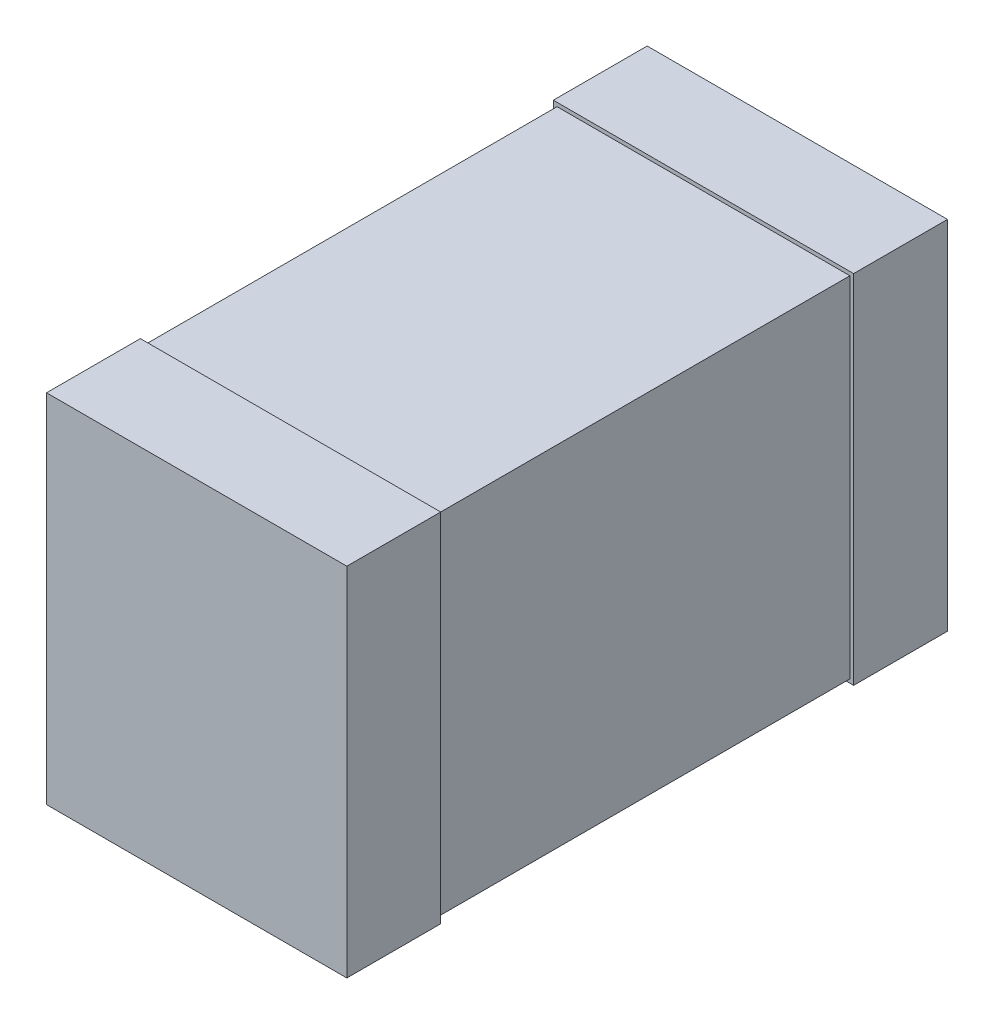
ISO-10303-21;
HEADER;
FILE_DESCRIPTION(('STEP AP214'),'2;1');
FILE_NAME('part.step','',(''),(''),'','','');
FILE_SCHEMA(('AUTOMOTIVE_DESIGN { 1 0 10303 214 1 1 1 1 }'));
ENDSEC;
DATA;
#1=APPLICATION_CONTEXT('core data for automotive mechanical design processes');
#2=APPLICATION_PROTOCOL_DEFINITION('international standard','automotive_design',2000,#1);
#3=PRODUCT_CONTEXT('',#1,'mechanical');
#4=PRODUCT('Part','Part','',(#3));
#5=PRODUCT_RELATED_PRODUCT_CATEGORY('part','',(#4));
#6=PRODUCT_DEFINITION_FORMATION('','',#4);
#7=PRODUCT_DEFINITION_CONTEXT('part definition',#1,'design');
#8=PRODUCT_DEFINITION('design','',#6,#7);
#9=PRODUCT_DEFINITION_SHAPE('','',#8);
#10=(LENGTH_UNIT() NAMED_UNIT(*) SI_UNIT(.MILLI.,.METRE.));
#11=(NAMED_UNIT(*) PLANE_ANGLE_UNIT() SI_UNIT($,.RADIAN.));
#12=(NAMED_UNIT(*) SI_UNIT($,.STERADIAN.) SOLID_ANGLE_UNIT());
#13=UNCERTAINTY_MEASURE_WITH_UNIT(LENGTH_MEASURE(1.E-05),#10,'distance_accuracy_value','');
#14=(GEOMETRIC_REPRESENTATION_CONTEXT(3) GLOBAL_UNCERTAINTY_ASSIGNED_CONTEXT((#13)) GLOBAL_UNIT_ASSIGNED_CONTEXT((#10,
#11,#12)) REPRESENTATION_CONTEXT('',''));
#15=CARTESIAN_POINT('',(0.,0.,0.));
#16=DIRECTION('',(0.,0.,1.));
#17=DIRECTION('',(1.,0.,0.));
#18=AXIS2_PLACEMENT_3D('',#15,#16,#17);
#19=CARTESIAN_POINT('',(0.8,-0.95,1.6));
#20=DIRECTION('',(0.,0.,-1.));
#21=DIRECTION('',(-1.,0.,0.));
#22=AXIS2_PLACEMENT_3D('',#19,#20,#21);
#23=PLANE('',#22);
#24=DIRECTION('',(-1.,0.,0.));
#25=VECTOR('',#24,1.);
#26=CARTESIAN_POINT('',(0.,0.95,1.6));
#27=LINE('',#26,#25);
#28=CARTESIAN_POINT('',(0.8,0.95,1.6));
#29=VERTEX_POINT('',#28);
#30=CARTESIAN_POINT('',(-0.8,0.95,1.6));
#31=VERTEX_POINT('',#30);
#32=EDGE_CURVE('E108',#29,#31,#27,.T.);
#33=ORIENTED_EDGE('',*,*,#32,.T.);
#34=DIRECTION('',(0.,-1.,0.));
#35=VECTOR('',#34,1.);
#36=CARTESIAN_POINT('',(-0.8,0.,1.6));
#37=LINE('',#36,#35);
#38=CARTESIAN_POINT('',(-0.8,-0.95,1.6));
#39=VERTEX_POINT('',#38);
#40=EDGE_CURVE('E103',#31,#39,#37,.T.);
#41=ORIENTED_EDGE('',*,*,#40,.T.);
#42=DIRECTION('',(-1.,0.,0.));
#43=VECTOR('',#42,1.);
#44=CARTESIAN_POINT('',(0.,-0.95,1.6));
#45=LINE('',#44,#43);
#46=CARTESIAN_POINT('',(0.8,-0.95,1.6));
#47=VERTEX_POINT('',#46);
#48=EDGE_CURVE('E20',#47,#39,#45,.T.);
#49=ORIENTED_EDGE('',*,*,#48,.F.);
#50=DIRECTION('',(0.,1.,0.));
#51=VECTOR('',#50,1.);
#52=CARTESIAN_POINT('',(0.8,0.,1.6));
#53=LINE('',#52,#51);
#54=EDGE_CURVE('E117',#47,#29,#53,.T.);
#55=ORIENTED_EDGE('',*,*,#54,.T.);
#56=EDGE_LOOP('',(#33,#41,#49,#55));
#57=FACE_BOUND('',#56,.T.);
#58=ADVANCED_FACE('F16',(#57),#23,.F.);
#59=CARTESIAN_POINT('',(0.8,-0.95,1.1));
#60=DIRECTION('',(-1.,0.,0.));
#61=DIRECTION('',(0.,0.,1.));
#62=AXIS2_PLACEMENT_3D('',#59,#60,#61);
#63=PLANE('',#62);
#64=DIRECTION('',(0.,1.,0.));
#65=VECTOR('',#64,1.);
#66=CARTESIAN_POINT('',(0.8,0.,1.1));
#67=LINE('',#66,#65);
#68=CARTESIAN_POINT('',(0.8,-0.95,1.1));
#69=VERTEX_POINT('',#68);
#70=CARTESIAN_POINT('',(0.8,0.95,1.1));
#71=VERTEX_POINT('',#70);
#72=EDGE_CURVE('E125',#69,#71,#67,.T.);
#73=ORIENTED_EDGE('',*,*,#72,.T.);
#74=DIRECTION('',(0.,0.,1.));
#75=VECTOR('',#74,1.);
#76=CARTESIAN_POINT('',(0.8,0.95,1.35));
#77=LINE('',#76,#75);
#78=EDGE_CURVE('E113',#71,#29,#77,.T.);
#79=ORIENTED_EDGE('',*,*,#78,.T.);
#80=ORIENTED_EDGE('',*,*,#54,.F.);
#81=DIRECTION('',(0.,0.,-1.));
#82=VECTOR('',#81,1.);
#83=CARTESIAN_POINT('',(0.8,-0.95,1.35));
#84=LINE('',#83,#82);
#85=EDGE_CURVE('E130',#47,#69,#84,.T.);
#86=ORIENTED_EDGE('',*,*,#85,.T.);
#87=EDGE_LOOP('',(#73,#79,#80,#86));
#88=FACE_BOUND('',#87,.T.);
#89=ADVANCED_FACE('F124',(#88),#63,.F.);
#90=CARTESIAN_POINT('',(-0.8,0.95,1.6));
#91=DIRECTION('',(0.,-1.,0.));
#92=DIRECTION('',(0.,0.,-1.));
#93=AXIS2_PLACEMENT_3D('',#90,#91,#92);
#94=PLANE('',#93);
#95=DIRECTION('',(-1.,0.,0.));
#96=VECTOR('',#95,1.);
#97=CARTESIAN_POINT('',(0.,0.95,1.1));
#98=LINE('',#97,#96);
#99=CARTESIAN_POINT('',(-0.8,0.95,1.1));
#100=VERTEX_POINT('',#99);
#101=EDGE_CURVE('E135',#71,#100,#98,.T.);
#102=ORIENTED_EDGE('',*,*,#101,.T.);
#103=DIRECTION('',(0.,0.,1.));
#104=VECTOR('',#103,1.);
#105=CARTESIAN_POINT('',(-0.8,0.95,1.35));
#106=LINE('',#105,#104);
#107=EDGE_CURVE('E115',#100,#31,#106,.T.);
#108=ORIENTED_EDGE('',*,*,#107,.T.);
#109=ORIENTED_EDGE('',*,*,#32,.F.);
#110=ORIENTED_EDGE('',*,*,#78,.F.);
#111=EDGE_LOOP('',(#102,#108,#109,#110));
#112=FACE_BOUND('',#111,.T.);
#113=ADVANCED_FACE('F111',(#112),#94,.F.);
#114=CARTESIAN_POINT('',(-0.8,-0.95,1.6));
#115=DIRECTION('',(1.,0.,0.));
#116=DIRECTION('',(0.,0.,-1.));
#117=AXIS2_PLACEMENT_3D('',#114,#115,#116);
#118=PLANE('',#117);
#119=DIRECTION('',(0.,-1.,0.));
#120=VECTOR('',#119,1.);
#121=CARTESIAN_POINT('',(-0.8,0.,1.1));
#122=LINE('',#121,#120);
#123=CARTESIAN_POINT('',(-0.8,-0.95,1.1));
#124=VERTEX_POINT('',#123);
#125=EDGE_CURVE('E137',#100,#124,#122,.T.);
#126=ORIENTED_EDGE('',*,*,#125,.T.);
#127=DIRECTION('',(0.,0.,1.));
#128=VECTOR('',#127,1.);
#129=CARTESIAN_POINT('',(-0.8,-0.95,1.35));
#130=LINE('',#129,#128);
#131=EDGE_CURVE('E132',#124,#39,#130,.T.);
#132=ORIENTED_EDGE('',*,*,#131,.T.);
#133=ORIENTED_EDGE('',*,*,#40,.F.);
#134=ORIENTED_EDGE('',*,*,#107,.F.);
#135=EDGE_LOOP('',(#126,#132,#133,#134));
#136=FACE_BOUND('',#135,.T.);
#137=ADVANCED_FACE('F252',(#136),#118,.F.);
#138=CARTESIAN_POINT('',(-0.8,-0.95,1.1));
#139=DIRECTION('',(0.,1.,0.));
#140=DIRECTION('',(0.,0.,1.));
#141=AXIS2_PLACEMENT_3D('',#138,#139,#140);
#142=PLANE('',#141);
#143=DIRECTION('',(1.,0.,0.));
#144=VECTOR('',#143,1.);
#145=CARTESIAN_POINT('',(0.,-0.95,1.1));
#146=LINE('',#145,#144);
#147=EDGE_CURVE('E140',#124,#69,#146,.T.);
#148=ORIENTED_EDGE('',*,*,#147,.T.);
#149=ORIENTED_EDGE('',*,*,#85,.F.);
#150=ORIENTED_EDGE('',*,*,#48,.T.);
#151=ORIENTED_EDGE('',*,*,#131,.F.);
#152=EDGE_LOOP('',(#148,#149,#150,#151));
#153=FACE_BOUND('',#152,.T.);
#154=ADVANCED_FACE('F248',(#153),#142,.F.);
#155=CARTESIAN_POINT('',(-0.8,-0.95,1.1));
#156=DIRECTION('',(0.,0.,1.));
#157=DIRECTION('',(1.,0.,0.));
#158=AXIS2_PLACEMENT_3D('',#155,#156,#157);
#159=PLANE('',#158);
#160=DIRECTION('',(1.,0.,0.));
#161=VECTOR('',#160,1.);
#162=CARTESIAN_POINT('',(0.,0.93,1.1));
#163=LINE('',#162,#161);
#164=CARTESIAN_POINT('',(-0.78,0.9299999998,1.1));
#165=VERTEX_POINT('',#164);
#166=CARTESIAN_POINT('',(0.78,0.9299999998,1.1));
#167=VERTEX_POINT('',#166);
#168=EDGE_CURVE('E147',#165,#167,#163,.T.);
#169=ORIENTED_EDGE('',*,*,#168,.F.);
#170=DIRECTION('',(0.,1.,0.));
#171=VECTOR('',#170,1.);
#172=CARTESIAN_POINT('',(-0.78,0.,1.1));
#173=LINE('',#172,#171);
#174=CARTESIAN_POINT('',(-0.78,-0.9299999998,1.1));
#175=VERTEX_POINT('',#174);
#176=EDGE_CURVE('E160',#175,#165,#173,.T.);
#177=ORIENTED_EDGE('',*,*,#176,.F.);
#178=DIRECTION('',(-1.,0.,0.));
#179=VECTOR('',#178,1.);
#180=CARTESIAN_POINT('',(0.,-0.93,1.1));
#181=LINE('',#180,#179);
#182=CARTESIAN_POINT('',(0.78,-0.9299999998,1.1));
#183=VERTEX_POINT('',#182);
#184=EDGE_CURVE('E143',#183,#175,#181,.T.);
#185=ORIENTED_EDGE('',*,*,#184,.F.);
#186=DIRECTION('',(0.,-1.,0.));
#187=VECTOR('',#186,1.);
#188=CARTESIAN_POINT('',(0.78,0.,1.1));
#189=LINE('',#188,#187);
#190=EDGE_CURVE('E168',#167,#183,#189,.T.);
#191=ORIENTED_EDGE('',*,*,#190,.F.);
#192=EDGE_LOOP('',(#169,#177,#185,#191));
#193=FACE_BOUND('',#192,.T.);
#194=ORIENTED_EDGE('',*,*,#125,.F.);
#195=ORIENTED_EDGE('',*,*,#101,.F.);
#196=ORIENTED_EDGE('',*,*,#72,.F.);
#197=ORIENTED_EDGE('',*,*,#147,.F.);
#198=EDGE_LOOP('',(#194,#195,#196,#197));
#199=FACE_BOUND('',#198,.T.);
#200=ADVANCED_FACE('F244',(#193,#199),#159,.F.);
#201=CARTESIAN_POINT('',(-0.78,-0.93,1.1));
#202=DIRECTION('',(0.,-1.,0.));
#203=DIRECTION('',(0.,0.,-1.));
#204=AXIS2_PLACEMENT_3D('',#201,#202,#203);
#205=PLANE('',#204);
#206=DIRECTION('',(1.,0.,0.));
#207=VECTOR('',#206,1.);
#208=CARTESIAN_POINT('',(0.,-0.93,-1.1));
#209=LINE('',#208,#207);
#210=CARTESIAN_POINT('',(-0.78,-0.9299999999,-1.1));
#211=VERTEX_POINT('',#210);
#212=CARTESIAN_POINT('',(0.78,-0.9299999999,-1.1));
#213=VERTEX_POINT('',#212);
#214=EDGE_CURVE('E145',#211,#213,#209,.T.);
#215=ORIENTED_EDGE('',*,*,#214,.T.);
#216=DIRECTION('',(0.,0.,-1.));
#217=VECTOR('',#216,1.);
#218=CARTESIAN_POINT('',(0.78,-0.93,0.));
#219=LINE('',#218,#217);
#220=EDGE_CURVE('E170',#183,#213,#219,.T.);
#221=ORIENTED_EDGE('',*,*,#220,.F.);
#222=ORIENTED_EDGE('',*,*,#184,.T.);
#223=DIRECTION('',(0.,0.,1.));
#224=VECTOR('',#223,1.);
#225=CARTESIAN_POINT('',(-0.78,-0.93,0.));
#226=LINE('',#225,#224);
#227=EDGE_CURVE('E165',#211,#175,#226,.T.);
#228=ORIENTED_EDGE('',*,*,#227,.F.);
#229=EDGE_LOOP('',(#215,#221,#222,#228));
#230=FACE_BOUND('',#229,.T.);
#231=ADVANCED_FACE('F240',(#230),#205,.T.);
#232=CARTESIAN_POINT('',(-0.78,0.93,-1.1));
#233=DIRECTION('',(0.,1.,0.));
#234=DIRECTION('',(0.,0.,1.));
#235=AXIS2_PLACEMENT_3D('',#232,#233,#234);
#236=PLANE('',#235);
#237=DIRECTION('',(-1.,0.,0.));
#238=VECTOR('',#237,1.);
#239=CARTESIAN_POINT('',(0.,0.93,-1.1));
#240=LINE('',#239,#238);
#241=CARTESIAN_POINT('',(0.78,0.9299999999,-1.1));
#242=VERTEX_POINT('',#241);
#243=CARTESIAN_POINT('',(-0.78,0.9299999999,-1.1));
#244=VERTEX_POINT('',#243);
#245=EDGE_CURVE('E149',#242,#244,#240,.T.);
#246=ORIENTED_EDGE('',*,*,#245,.T.);
#247=DIRECTION('',(0.,0.,-1.));
#248=VECTOR('',#247,1.);
#249=CARTESIAN_POINT('',(-0.78,0.93,0.));
#250=LINE('',#249,#248);
#251=EDGE_CURVE('E162',#165,#244,#250,.T.);
#252=ORIENTED_EDGE('',*,*,#251,.F.);
#253=ORIENTED_EDGE('',*,*,#168,.T.);
#254=DIRECTION('',(0.,0.,1.));
#255=VECTOR('',#254,1.);
#256=CARTESIAN_POINT('',(0.78,0.93,0.));
#257=LINE('',#256,#255);
#258=EDGE_CURVE('E173',#242,#167,#257,.T.);
#259=ORIENTED_EDGE('',*,*,#258,.F.);
#260=EDGE_LOOP('',(#246,#252,#253,#259));
#261=FACE_BOUND('',#260,.T.);
#262=ADVANCED_FACE('F237',(#261),#236,.T.);
#263=CARTESIAN_POINT('',(-0.8,-0.95,-1.6));
#264=DIRECTION('',(0.,1.,0.));
#265=DIRECTION('',(0.,0.,1.));
#266=AXIS2_PLACEMENT_3D('',#263,#264,#265);
#267=PLANE('',#266);
#268=DIRECTION('',(0.,0.,-1.));
#269=VECTOR('',#268,1.);
#270=CARTESIAN_POINT('',(-0.8,-0.95,-1.35));
#271=LINE('',#270,#269);
#272=CARTESIAN_POINT('',(-0.8,-0.95,-1.1));
#273=VERTEX_POINT('',#272);
#274=CARTESIAN_POINT('',(-0.8,-0.95,-1.6));
#275=VERTEX_POINT('',#274);
#276=EDGE_CURVE('E154',#273,#275,#271,.T.);
#277=ORIENTED_EDGE('',*,*,#276,.T.);
#278=DIRECTION('',(-1.,0.,0.));
#279=VECTOR('',#278,1.);
#280=CARTESIAN_POINT('',(0.,-0.95,-1.6));
#281=LINE('',#280,#279);
#282=CARTESIAN_POINT('',(0.8,-0.95,-1.6));
#283=VERTEX_POINT('',#282);
#284=EDGE_CURVE('E176',#283,#275,#281,.T.);
#285=ORIENTED_EDGE('',*,*,#284,.F.);
#286=DIRECTION('',(0.,0.,-1.));
#287=VECTOR('',#286,1.);
#288=CARTESIAN_POINT('',(0.8,-0.95,-1.35));
#289=LINE('',#288,#287);
#290=CARTESIAN_POINT('',(0.8,-0.95,-1.1));
#291=VERTEX_POINT('',#290);
#292=EDGE_CURVE('E35',#291,#283,#289,.T.);
#293=ORIENTED_EDGE('',*,*,#292,.F.);
#294=DIRECTION('',(1.,0.,0.));
#295=VECTOR('',#294,1.);
#296=CARTESIAN_POINT('',(0.,-0.95,-1.1));
#297=LINE('',#296,#295);
#298=EDGE_CURVE('E184',#273,#291,#297,.T.);
#299=ORIENTED_EDGE('',*,*,#298,.F.);
#300=EDGE_LOOP('',(#277,#285,#293,#299));
#301=FACE_BOUND('',#300,.T.);
#302=ADVANCED_FACE('F205',(#301),#267,.F.);
#303=CARTESIAN_POINT('',(-0.8,0.95,-1.1));
#304=DIRECTION('',(0.,-1.,0.));
#305=DIRECTION('',(0.,0.,-1.));
#306=AXIS2_PLACEMENT_3D('',#303,#304,#305);
#307=PLANE('',#306);
#308=DIRECTION('',(0.,0.,1.));
#309=VECTOR('',#308,1.);
#310=CARTESIAN_POINT('',(0.8,0.95,-1.35));
#311=LINE('',#310,#309);
#312=CARTESIAN_POINT('',(0.8,0.95,-1.6));
#313=VERTEX_POINT('',#312);
#314=CARTESIAN_POINT('',(0.8,0.95,-1.1));
#315=VERTEX_POINT('',#314);
#316=EDGE_CURVE('E152',#313,#315,#311,.T.);
#317=ORIENTED_EDGE('',*,*,#316,.F.);
#318=DIRECTION('',(1.,0.,0.));
#319=VECTOR('',#318,1.);
#320=CARTESIAN_POINT('',(0.,0.95,-1.6));
#321=LINE('',#320,#319);
#322=CARTESIAN_POINT('',(-0.8,0.95,-1.6));
#323=VERTEX_POINT('',#322);
#324=EDGE_CURVE('E181',#323,#313,#321,.T.);
#325=ORIENTED_EDGE('',*,*,#324,.F.);
#326=DIRECTION('',(0.,0.,1.));
#327=VECTOR('',#326,1.);
#328=CARTESIAN_POINT('',(-0.8,0.95,-1.35));
#329=LINE('',#328,#327);
#330=CARTESIAN_POINT('',(-0.8,0.95,-1.1));
#331=VERTEX_POINT('',#330);
#332=EDGE_CURVE('E157',#323,#331,#329,.T.);
#333=ORIENTED_EDGE('',*,*,#332,.T.);
#334=DIRECTION('',(-1.,0.,0.));
#335=VECTOR('',#334,1.);
#336=CARTESIAN_POINT('',(0.,0.95,-1.1));
#337=LINE('',#336,#335);
#338=EDGE_CURVE('E186',#315,#331,#337,.T.);
#339=ORIENTED_EDGE('',*,*,#338,.F.);
#340=EDGE_LOOP('',(#317,#325,#333,#339));
#341=FACE_BOUND('',#340,.T.);
#342=ADVANCED_FACE('F211',(#341),#307,.F.);
#343=CARTESIAN_POINT('',(-0.8,-0.95,-1.1));
#344=DIRECTION('',(1.,0.,0.));
#345=DIRECTION('',(0.,0.,-1.));
#346=AXIS2_PLACEMENT_3D('',#343,#344,#345);
#347=PLANE('',#346);
#348=ORIENTED_EDGE('',*,*,#332,.F.);
#349=DIRECTION('',(0.,1.,0.));
#350=VECTOR('',#349,1.);
#351=CARTESIAN_POINT('',(-0.8,0.,-1.6));
#352=LINE('',#351,#350);
#353=EDGE_CURVE('E178',#275,#323,#352,.T.);
#354=ORIENTED_EDGE('',*,*,#353,.F.);
#355=ORIENTED_EDGE('',*,*,#276,.F.);
#356=DIRECTION('',(0.,-1.,0.));
#357=VECTOR('',#356,1.);
#358=CARTESIAN_POINT('',(-0.8,0.,-1.1));
#359=LINE('',#358,#357);
#360=EDGE_CURVE('E188',#331,#273,#359,.T.);
#361=ORIENTED_EDGE('',*,*,#360,.F.);
#362=EDGE_LOOP('',(#348,#354,#355,#361));
#363=FACE_BOUND('',#362,.T.);
#364=ADVANCED_FACE('F209',(#363),#347,.F.);
#365=CARTESIAN_POINT('',(-0.78,-0.93,-1.1));
#366=DIRECTION('',(-1.,0.,0.));
#367=DIRECTION('',(0.,0.,1.));
#368=AXIS2_PLACEMENT_3D('',#365,#366,#367);
#369=PLANE('',#368);
#370=DIRECTION('',(0.,1.,0.));
#371=VECTOR('',#370,1.);
#372=CARTESIAN_POINT('',(-0.78,0.,-1.1));
#373=LINE('',#372,#371);
#374=EDGE_CURVE('E191',#211,#244,#373,.T.);
#375=ORIENTED_EDGE('',*,*,#374,.F.);
#376=ORIENTED_EDGE('',*,*,#227,.T.);
#377=ORIENTED_EDGE('',*,*,#176,.T.);
#378=ORIENTED_EDGE('',*,*,#251,.T.);
#379=EDGE_LOOP('',(#375,#376,#377,#378));
#380=FACE_BOUND('',#379,.T.);
#381=ADVANCED_FACE('F226',(#380),#369,.T.);
#382=CARTESIAN_POINT('',(0.78,-0.93,1.1));
#383=DIRECTION('',(1.,0.,0.));
#384=DIRECTION('',(0.,0.,-1.));
#385=AXIS2_PLACEMENT_3D('',#382,#383,#384);
#386=PLANE('',#385);
#387=DIRECTION('',(0.,-1.,0.));
#388=VECTOR('',#387,1.);
#389=CARTESIAN_POINT('',(0.78,0.,-1.1));
#390=LINE('',#389,#388);
#391=EDGE_CURVE('E194',#242,#213,#390,.T.);
#392=ORIENTED_EDGE('',*,*,#391,.F.);
#393=ORIENTED_EDGE('',*,*,#258,.T.);
#394=ORIENTED_EDGE('',*,*,#190,.T.);
#395=ORIENTED_EDGE('',*,*,#220,.T.);
#396=EDGE_LOOP('',(#392,#393,#394,#395));
#397=FACE_BOUND('',#396,.T.);
#398=ADVANCED_FACE('F221',(#397),#386,.T.);
#399=CARTESIAN_POINT('',(0.8,-0.95,-1.6));
#400=DIRECTION('',(0.,0.,-1.));
#401=DIRECTION('',(-1.,0.,0.));
#402=AXIS2_PLACEMENT_3D('',#399,#400,#401);
#403=PLANE('',#402);
#404=ORIENTED_EDGE('',*,*,#353,.T.);
#405=ORIENTED_EDGE('',*,*,#324,.T.);
#406=DIRECTION('',(0.,-1.,0.));
#407=VECTOR('',#406,1.);
#408=CARTESIAN_POINT('',(0.8,0.,-1.6));
#409=LINE('',#408,#407);
#410=EDGE_CURVE('E26',#313,#283,#409,.T.);
#411=ORIENTED_EDGE('',*,*,#410,.T.);
#412=ORIENTED_EDGE('',*,*,#284,.T.);
#413=EDGE_LOOP('',(#404,#405,#411,#412));
#414=FACE_BOUND('',#413,.T.);
#415=ADVANCED_FACE('F200',(#414),#403,.T.);
#416=CARTESIAN_POINT('',(-0.8,-0.95,-1.1));
#417=DIRECTION('',(0.,0.,1.));
#418=DIRECTION('',(1.,0.,0.));
#419=AXIS2_PLACEMENT_3D('',#416,#417,#418);
#420=PLANE('',#419);
#421=ORIENTED_EDGE('',*,*,#245,.F.);
#422=ORIENTED_EDGE('',*,*,#391,.T.);
#423=ORIENTED_EDGE('',*,*,#214,.F.);
#424=ORIENTED_EDGE('',*,*,#374,.T.);
#425=EDGE_LOOP('',(#421,#422,#423,#424));
#426=FACE_BOUND('',#425,.T.);
#427=ORIENTED_EDGE('',*,*,#338,.T.);
#428=ORIENTED_EDGE('',*,*,#360,.T.);
#429=ORIENTED_EDGE('',*,*,#298,.T.);
#430=DIRECTION('',(0.,1.,0.));
#431=VECTOR('',#430,1.);
#432=CARTESIAN_POINT('',(0.8,0.,-1.1));
#433=LINE('',#432,#431);
#434=EDGE_CURVE('E11',#291,#315,#433,.T.);
#435=ORIENTED_EDGE('',*,*,#434,.T.);
#436=EDGE_LOOP('',(#427,#428,#429,#435));
#437=FACE_BOUND('',#436,.T.);
#438=ADVANCED_FACE('F213',(#426,#437),#420,.T.);
#439=CARTESIAN_POINT('',(0.8,-0.95,-1.6));
#440=DIRECTION('',(-1.,0.,0.));
#441=DIRECTION('',(0.,0.,1.));
#442=AXIS2_PLACEMENT_3D('',#439,#440,#441);
#443=PLANE('',#442);
#444=ORIENTED_EDGE('',*,*,#292,.T.);
#445=ORIENTED_EDGE('',*,*,#410,.F.);
#446=ORIENTED_EDGE('',*,*,#316,.T.);
#447=ORIENTED_EDGE('',*,*,#434,.F.);
#448=EDGE_LOOP('',(#444,#445,#446,#447));
#449=FACE_BOUND('',#448,.T.);
#450=ADVANCED_FACE('F18',(#449),#443,.F.);
#451=CLOSED_SHELL('',(#58,#89,#113,#137,#154,#200,#231,#262,#302,#342,#364,#381,#398,#415,#438,#450));
#452=MANIFOLD_SOLID_BREP('B1',#451);
#453=ADVANCED_BREP_SHAPE_REPRESENTATION('',(#18,#452),#14);
#454=SHAPE_DEFINITION_REPRESENTATION(#9,#453);
ENDSEC;
END-ISO-10303-21;
